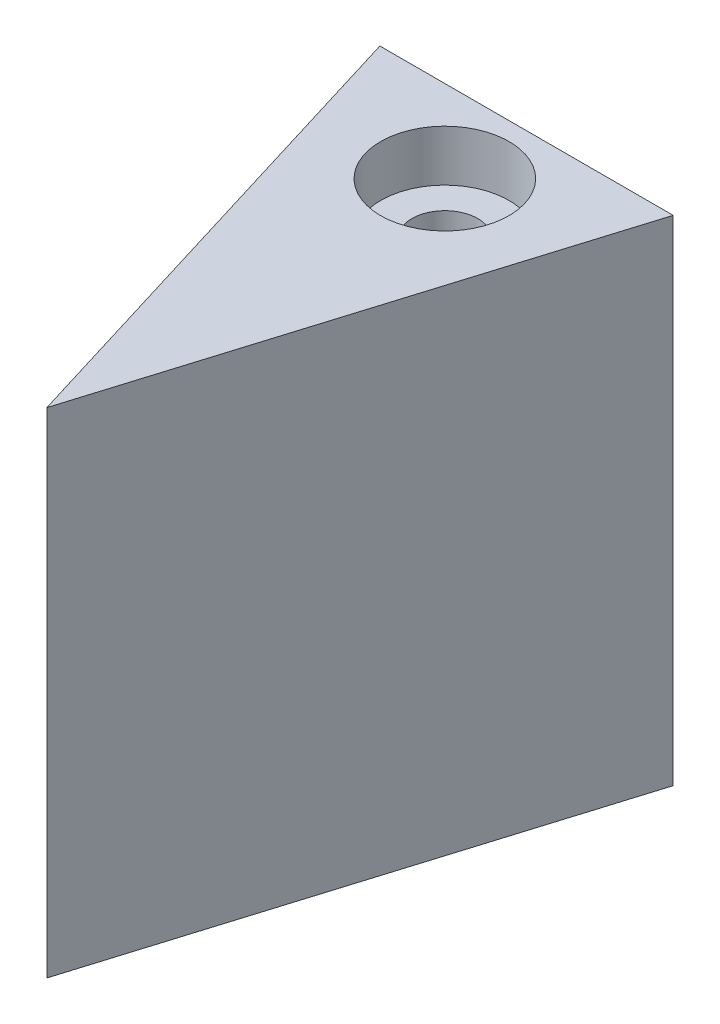
ISO-10303-21;
HEADER;
FILE_DESCRIPTION(('STEP AP214'),'2;1');
FILE_NAME('part.step','',(''),(''),'','','');
FILE_SCHEMA(('AUTOMOTIVE_DESIGN { 1 0 10303 214 1 1 1 1 }'));
ENDSEC;
DATA;
#1=APPLICATION_CONTEXT('core data for automotive mechanical design processes');
#2=APPLICATION_PROTOCOL_DEFINITION('international standard','automotive_design',2000,#1);
#3=PRODUCT_CONTEXT('',#1,'mechanical');
#4=PRODUCT('Part','Part','',(#3));
#5=PRODUCT_RELATED_PRODUCT_CATEGORY('part','',(#4));
#6=PRODUCT_DEFINITION_FORMATION('','',#4);
#7=PRODUCT_DEFINITION_CONTEXT('part definition',#1,'design');
#8=PRODUCT_DEFINITION('design','',#6,#7);
#9=PRODUCT_DEFINITION_SHAPE('','',#8);
#10=(LENGTH_UNIT() NAMED_UNIT(*) SI_UNIT(.MILLI.,.METRE.));
#11=(NAMED_UNIT(*) PLANE_ANGLE_UNIT() SI_UNIT($,.RADIAN.));
#12=(NAMED_UNIT(*) SI_UNIT($,.STERADIAN.) SOLID_ANGLE_UNIT());
#13=UNCERTAINTY_MEASURE_WITH_UNIT(LENGTH_MEASURE(1.E-05),#10,'distance_accuracy_value','');
#14=(GEOMETRIC_REPRESENTATION_CONTEXT(3) GLOBAL_UNCERTAINTY_ASSIGNED_CONTEXT((#13)) GLOBAL_UNIT_ASSIGNED_CONTEXT((#10,
#11,#12)) REPRESENTATION_CONTEXT('',''));
#15=CARTESIAN_POINT('',(0.,0.,0.));
#16=DIRECTION('',(0.,0.,1.));
#17=DIRECTION('',(1.,0.,0.));
#18=AXIS2_PLACEMENT_3D('',#15,#16,#17);
#19=CARTESIAN_POINT('',(-4.47328382881108,-2.51,4.56537000902889));
#20=DIRECTION('',(0.956304755963033,0.,-0.292371704722745));
#21=DIRECTION('',(-0.292371704722745,0.,-0.956304755963033));
#22=AXIS2_PLACEMENT_3D('',#19,#20,#21);
#23=PLANE('',#22);
#24=DIRECTION('',(0.,1.,0.));
#25=VECTOR('',#24,1.);
#26=CARTESIAN_POINT('',(-0.0200292878637927,-2.51,19.1313092850622));
#27=LINE('',#26,#25);
#28=CARTESIAN_POINT('',(-0.0200292878637948,-2.5,19.1313092850622));
#29=VERTEX_POINT('',#28);
#30=CARTESIAN_POINT('',(-0.0200292878637948,12.5,19.1313092850622));
#31=VERTEX_POINT('',#30);
#32=EDGE_CURVE('E11',#29,#31,#27,.T.);
#33=ORIENTED_EDGE('',*,*,#32,.T.);
#34=DIRECTION('',(-0.292371704722745,0.,-0.956304755963033));
#35=VECTOR('',#34,1.);
#36=CARTESIAN_POINT('',(-5.36736335318275,12.5,1.64096765560485));
#37=LINE('',#36,#35);
#38=CARTESIAN_POINT('',(-4.47328382881108,12.5,4.56537000902889));
#39=VERTEX_POINT('',#38);
#40=EDGE_CURVE('E42',#31,#39,#37,.T.);
#41=ORIENTED_EDGE('',*,*,#40,.T.);
#42=DIRECTION('',(0.,-1.,0.));
#43=VECTOR('',#42,1.);
#44=CARTESIAN_POINT('',(-4.47328382881108,-2.5,4.56537000902889));
#45=LINE('',#44,#43);
#46=CARTESIAN_POINT('',(-4.47328382881108,-2.5,4.56537000902889));
#47=VERTEX_POINT('',#46);
#48=EDGE_CURVE('E58',#39,#47,#45,.T.);
#49=ORIENTED_EDGE('',*,*,#48,.T.);
#50=DIRECTION('',(-0.292371704722745,0.,-0.956304755963033));
#51=VECTOR('',#50,1.);
#52=CARTESIAN_POINT('',(-5.36736335318275,-2.5,1.64096765560485));
#53=LINE('',#52,#51);
#54=EDGE_CURVE('E143',#29,#47,#53,.T.);
#55=ORIENTED_EDGE('',*,*,#54,.F.);
#56=EDGE_LOOP('',(#33,#41,#49,#55));
#57=FACE_BOUND('',#56,.T.);
#58=ADVANCED_FACE('F33',(#57),#23,.F.);
#59=CARTESIAN_POINT('',(-0.0200292878637927,-2.51,19.1313092850622));
#60=DIRECTION('',(-0.956304755963036,0.,-0.292371704722737));
#61=DIRECTION('',(-0.292371704722737,0.,0.956304755963036));
#62=AXIS2_PLACEMENT_3D('',#59,#60,#61);
#63=PLANE('',#62);
#64=DIRECTION('',(0.,1.,0.));
#65=VECTOR('',#64,1.);
#66=CARTESIAN_POINT('',(4.43322525308335,-2.5,4.56537000902889));
#67=LINE('',#66,#65);
#68=CARTESIAN_POINT('',(4.43322525308335,-2.5,4.56537000902889));
#69=VERTEX_POINT('',#68);
#70=CARTESIAN_POINT('',(4.43322525308335,12.5,4.56537000902889));
#71=VERTEX_POINT('',#70);
#72=EDGE_CURVE('E156',#69,#71,#67,.T.);
#73=ORIENTED_EDGE('',*,*,#72,.T.);
#74=DIRECTION('',(-0.292371704722737,0.,0.956304755963036));
#75=VECTOR('',#74,1.);
#76=CARTESIAN_POINT('',(5.33072903312821,12.5,1.62976741996975));
#77=LINE('',#76,#75);
#78=EDGE_CURVE('E50',#71,#31,#77,.T.);
#79=ORIENTED_EDGE('',*,*,#78,.T.);
#80=ORIENTED_EDGE('',*,*,#32,.F.);
#81=DIRECTION('',(-0.292371704722737,0.,0.956304755963036));
#82=VECTOR('',#81,1.);
#83=CARTESIAN_POINT('',(5.33072903312821,-2.5,1.62976741996975));
#84=LINE('',#83,#82);
#85=EDGE_CURVE('E37',#69,#29,#84,.T.);
#86=ORIENTED_EDGE('',*,*,#85,.F.);
#87=EDGE_LOOP('',(#73,#79,#80,#86));
#88=FACE_BOUND('',#87,.T.);
#89=ADVANCED_FACE('F35',(#88),#63,.F.);
#90=CARTESIAN_POINT('',(-0.0200292878638651,5.,9.56537000902889));
#91=DIRECTION('',(0.,0.,-1.));
#92=DIRECTION('',(-1.,0.,0.));
#93=AXIS2_PLACEMENT_3D('',#90,#91,#92);
#94=PLANE('',#93);
#95=CARTESIAN_POINT('',(-0.0200292878638651,5.,9.56537000902889));
#96=DIRECTION('',(0.,0.,-1.));
#97=DIRECTION('',(-1.,0.,0.));
#98=AXIS2_PLACEMENT_3D('',#95,#96,#97);
#99=CIRCLE('',#98,3.05);
#100=CARTESIAN_POINT('',(2.87824606137402,4.05,9.56537000902889));
#101=VERTEX_POINT('',#100);
#102=CARTESIAN_POINT('',(-2.91830463710175,4.05,9.56537000902889));
#103=VERTEX_POINT('',#102);
#104=EDGE_CURVE('E124',#101,#103,#99,.T.);
#105=ORIENTED_EDGE('',*,*,#104,.T.);
#106=DIRECTION('',(1.,0.,0.));
#107=VECTOR('',#106,1.);
#108=CARTESIAN_POINT('',(2.87824606137402,4.05,9.56537000902889));
#109=LINE('',#108,#107);
#110=EDGE_CURVE('E127',#103,#101,#109,.T.);
#111=ORIENTED_EDGE('',*,*,#110,.T.);
#112=EDGE_LOOP('',(#105,#111));
#113=FACE_BOUND('',#112,.T.);
#114=ADVANCED_FACE('F221',(#113),#94,.T.);
#115=CARTESIAN_POINT('',(0.,-2.5,7.06537000902889));
#116=DIRECTION('',(0.,1.,0.));
#117=DIRECTION('',(0.,0.,1.));
#118=AXIS2_PLACEMENT_3D('',#115,#116,#117);
#119=CYLINDRICAL_SURFACE('',#118,0.999999999999795);
#120=CARTESIAN_POINT('',(0.,5.95,7.06537000902889));
#121=DIRECTION('',(0.,-1.,0.));
#122=DIRECTION('',(0.,0.,-1.));
#123=AXIS2_PLACEMENT_3D('',#120,#121,#122);
#124=CIRCLE('',#123,0.999999999999795);
#125=CARTESIAN_POINT('',(0.,5.95,6.06537000902909));
#126=VERTEX_POINT('',#125);
#127=EDGE_CURVE('E144',#126,#126,#124,.T.);
#128=ORIENTED_EDGE('',*,*,#127,.F.);
#129=EDGE_LOOP('',(#128));
#130=FACE_BOUND('',#129,.T.);
#131=CARTESIAN_POINT('',(0.,4.05,7.06537000902889));
#132=DIRECTION('',(0.,1.,0.));
#133=DIRECTION('',(0.,0.,1.));
#134=AXIS2_PLACEMENT_3D('',#131,#132,#133);
#135=CIRCLE('',#134,0.999999999999795);
#136=CARTESIAN_POINT('',(0.,4.05,8.06537000902868));
#137=VERTEX_POINT('',#136);
#138=EDGE_CURVE('E188',#137,#137,#135,.T.);
#139=ORIENTED_EDGE('',*,*,#138,.F.);
#140=EDGE_LOOP('',(#139));
#141=FACE_BOUND('',#140,.T.);
#142=ADVANCED_FACE('F198',(#130,#141),#119,.F.);
#143=CARTESIAN_POINT('',(-0.0200292878638651,5.,9.56537000902889));
#144=DIRECTION('',(0.,0.,-1.));
#145=DIRECTION('',(-1.,0.,0.));
#146=AXIS2_PLACEMENT_3D('',#143,#144,#145);
#147=PLANE('',#146);
#148=CARTESIAN_POINT('',(-0.0200292878638651,5.,9.56537000902889));
#149=DIRECTION('',(0.,0.,-1.));
#150=DIRECTION('',(-1.,0.,0.));
#151=AXIS2_PLACEMENT_3D('',#148,#149,#150);
#152=CIRCLE('',#151,3.05);
#153=CARTESIAN_POINT('',(-2.91830463710175,5.95,9.56537000902889));
#154=VERTEX_POINT('',#153);
#155=CARTESIAN_POINT('',(2.87824606137402,5.95,9.56537000902889));
#156=VERTEX_POINT('',#155);
#157=EDGE_CURVE('E100',#154,#156,#152,.T.);
#158=ORIENTED_EDGE('',*,*,#157,.T.);
#159=DIRECTION('',(-1.,0.,0.));
#160=VECTOR('',#159,1.);
#161=CARTESIAN_POINT('',(2.87824606137402,5.95,9.56537000902889));
#162=LINE('',#161,#160);
#163=EDGE_CURVE('E109',#156,#154,#162,.T.);
#164=ORIENTED_EDGE('',*,*,#163,.T.);
#165=EDGE_LOOP('',(#158,#164));
#166=FACE_BOUND('',#165,.T.);
#167=ADVANCED_FACE('F112',(#166),#147,.T.);
#168=CARTESIAN_POINT('',(0.,8.04993423332826,8.06537000902868));
#169=CARTESIAN_POINT('',(0.0546821791008591,8.04957510796066,8.06537003134291));
#170=CARTESIAN_POINT('',(0.109354914126314,8.04773172784493,8.0608700796451));
#171=CARTESIAN_POINT('',(0.217072928600975,8.04124911512673,8.0430513451388));
#172=CARTESIAN_POINT('',(0.270117951898954,8.03660944482241,8.02973118167488));
#173=CARTESIAN_POINT('',(0.373013096085542,8.02501178523379,7.9947834956713));
#174=CARTESIAN_POINT('',(0.422868473539478,8.01805773388006,7.97317007466059));
#175=CARTESIAN_POINT('',(0.518239677542278,8.00251631313627,7.92231226129294));
#176=CARTESIAN_POINT('',(0.563754694999946,7.99392864011109,7.89306644995588));
#177=CARTESIAN_POINT('',(0.650728756928365,7.97567153728033,7.82670873711478));
#178=CARTESIAN_POINT('',(0.692016888170353,7.96597671144104,7.789379829442));
#179=CARTESIAN_POINT('',(0.767869116779319,7.94673554743408,7.7083762283634));
#180=CARTESIAN_POINT('',(0.802431776578928,7.93718924141278,7.66470018173609));
#181=CARTESIAN_POINT('',(0.864765151781457,7.91902793004534,7.5707826132558));
#182=CARTESIAN_POINT('',(0.892326299349008,7.91044519441132,7.52039518357941));
#183=CARTESIAN_POINT('',(0.938505856826815,7.89556616206647,7.41536260915563));
#184=CARTESIAN_POINT('',(0.957127077871142,7.88926914676962,7.36071880910146));
#185=CARTESIAN_POINT('',(0.984242433141647,7.87995461814357,7.25073786122397));
#186=CARTESIAN_POINT('',(0.993067689027361,7.87683020189835,7.19549165552765));
#187=CARTESIAN_POINT('',(1.00137637507627,7.87389140563375,7.0842210997125));
#188=CARTESIAN_POINT('',(1.00086267310011,7.87407600946129,7.02819699375629));
#189=CARTESIAN_POINT('',(0.99076096088365,7.87764266918273,6.91967266210838));
#190=CARTESIAN_POINT('',(0.981587657973599,7.88087859001705,6.86712821582431));
#191=CARTESIAN_POINT('',(0.955100149434765,7.8899509641507,6.76437204334019));
#192=CARTESIAN_POINT('',(0.937784973426303,7.89578772742408,6.71416059597993));
#193=CARTESIAN_POINT('',(0.895224866547381,7.90952145894585,6.61653210436769));
#194=CARTESIAN_POINT('',(0.869854126003332,7.91745075100137,6.56917464604347));
#195=CARTESIAN_POINT('',(0.811993742784764,7.93447527343163,6.47925869308694));
#196=CARTESIAN_POINT('',(0.779502046774439,7.94357083978839,6.43670158801433));
#197=CARTESIAN_POINT('',(0.706310455681535,7.96250407370069,6.35524458013623));
#198=CARTESIAN_POINT('',(0.665269123333407,7.97235562915799,6.31665408360598));
#199=CARTESIAN_POINT('',(0.57718349640282,7.99129803558887,6.24682351617368));
#200=CARTESIAN_POINT('',(0.530138584475256,8.00038880817212,6.21558420213093));
#201=CARTESIAN_POINT('',(0.430676287465459,8.01694054662288,6.16106484602444));
#202=CARTESIAN_POINT('',(0.378205748438876,8.0243825903494,6.13787563631923));
#203=CARTESIAN_POINT('',(0.269803272333861,8.03668686866806,6.10075330920549));
#204=CARTESIAN_POINT('',(0.213872509814023,8.04154997336318,6.08681706955583));
#205=CARTESIAN_POINT('',(0.102675980012124,8.04801791966975,6.06913107849329));
#206=CARTESIAN_POINT('',(0.0474822649655247,8.04975195790472,6.06497514173016));
#207=CARTESIAN_POINT('',(-0.0628415625782379,8.05019803748363,6.0658238541015));
#208=CARTESIAN_POINT('',(-0.11797168444029,8.04891060250071,6.07082691579136));
#209=CARTESIAN_POINT('',(-0.224905098860222,8.04356865345438,6.0895227717292));
#210=CARTESIAN_POINT('',(-0.27675855569376,8.03959688095123,6.10295488916953));
#211=CARTESIAN_POINT('',(-0.377465816854332,8.02940636298488,6.13781410513821));
#212=CARTESIAN_POINT('',(-0.426319262034692,8.02318734910412,6.15924215873627));
#213=CARTESIAN_POINT('',(-0.520961047176242,8.00897230857037,6.2100604659352));
#214=CARTESIAN_POINT('',(-0.566646489467878,8.0009368899842,6.2396309979426));
#215=CARTESIAN_POINT('',(-0.65254261544519,7.98401517307969,6.30568228657445));
#216=CARTESIAN_POINT('',(-0.692751707956591,7.97512862873551,6.34216504424128));
#217=CARTESIAN_POINT('',(-0.768368832186386,7.9570367257478,6.42287653863802));
#218=CARTESIAN_POINT('',(-0.803492685593696,7.94783427305369,6.46737277538544));
#219=CARTESIAN_POINT('',(-0.865812896971176,7.93056297373217,6.561814306128));
#220=CARTESIAN_POINT('',(-0.893009191170616,7.92249413622404,6.61175964395225));
#221=CARTESIAN_POINT('',(-0.938600028099442,7.908487452095,6.71573217026841));
#222=CARTESIAN_POINT('',(-0.957006080265417,7.90254682148472,6.76975391336835));
#223=CARTESIAN_POINT('',(-0.984385447206509,7.89356679235751,6.88036261430816));
#224=CARTESIAN_POINT('',(-0.993362642639482,7.89052620031194,6.93694850680402));
#225=CARTESIAN_POINT('',(-1.00133163032267,7.88782991758724,7.04818230585044));
#226=CARTESIAN_POINT('',(-1.00077845522218,7.8880199719282,7.10279422493158));
#227=CARTESIAN_POINT('',(-0.990816979227545,7.89138344959095,7.21110590212351));
#228=CARTESIAN_POINT('',(-0.981409159874996,7.89455671067717,7.26480570967594));
#229=CARTESIAN_POINT('',(-0.954326006544325,7.90340934975765,7.36885594585062));
#230=CARTESIAN_POINT('',(-0.936795159679116,7.9090448351629,7.41924801009586));
#231=CARTESIAN_POINT('',(-0.894078597598813,7.92216267155434,7.51641516301269));
#232=CARTESIAN_POINT('',(-0.868891247980455,7.92964541680364,7.56318947674054));
#233=CARTESIAN_POINT('',(-0.810369867509382,7.94598359665686,7.6538685388687));
#234=CARTESIAN_POINT('',(-0.776744477808668,7.95488269367938,7.69757735474066));
#235=CARTESIAN_POINT('',(-0.702796321419838,7.97283954400193,7.77888143930107));
#236=CARTESIAN_POINT('',(-0.662471761379352,7.98189733920272,7.81647506561977));
#237=CARTESIAN_POINT('',(-0.574566833244119,7.99951060425292,7.88580532807814));
#238=CARTESIAN_POINT('',(-0.526781666832324,8.00803733466461,7.91729045245042));
#239=CARTESIAN_POINT('',(-0.42631739774142,8.02324420992155,7.97174481231142));
#240=CARTESIAN_POINT('',(-0.373639825535698,8.02992492966523,7.99471669981805));
#241=CARTESIAN_POINT('',(-0.268082191246842,8.04033135878708,8.03027889077588));
#242=CARTESIAN_POINT('',(-0.215395649662781,8.0442075496374,8.0433995880839));
#243=CARTESIAN_POINT('',(-0.108469393021745,8.04918673358594,8.06094409709436));
#244=CARTESIAN_POINT('',(-0.0542300522364904,8.05029038935139,8.06536998689896));
#245=CARTESIAN_POINT('',(0.,8.04993423332826,8.06537000902868));
#246=B_SPLINE_CURVE_WITH_KNOTS('',3,(#168,#169,#170,#171,#172,#173,#174,#175,#176,#177,#178,
#179,#180,#181,#182,#183,#184,#185,#186,#187,#188,#189,#190,#191,#192,#193,#194,#195,#196,#197,
#198,#199,#200,#201,#202,#203,#204,#205,#206,#207,#208,#209,#210,#211,#212,#213,#214,#215,#216,
#217,#218,#219,#220,#221,#222,#223,#224,#225,#226,#227,#228,#229,#230,#231,#232,#233,#234,#235,
#236,#237,#238,#239,#240,#241,#242,#243,#244,#245),.UNSPECIFIED.,.T.,.F.,(4,2,2,2,2,2,2,2,2,2,2,
2,2,2,2,2,2,2,2,2,2,2,2,2,2,2,2,2,2,2,2,2,2,2,2,2,2,2,4),(0.,0.163850025249576,
0.327725704522648,0.491323962064708,0.654952656763252,0.823688007705309,0.992459386251062,
1.16580686426493,1.33909979790541,1.50633759959778,1.67352404581624,1.83308952664912,
1.99267402993055,2.15488479838887,2.31714240219587,2.48792062945066,2.65871643191758,
2.83138111770078,3.00398751137513,3.16928819199399,3.33456022528501,3.49495717905625,
3.65537329747941,3.81967478229688,3.98402390415546,4.15550728499603,4.32699204524211,
4.49825165341348,4.66944074819149,4.83247997411711,4.99551033400225,5.15574601024891,
5.31601591541804,5.48284858292629,5.64972598333098,5.8224532304353,5.99512662474744,
6.15766074540814,6.32015601487876),.UNSPECIFIED.);
#247=CARTESIAN_POINT('',(0.,8.04993423332826,8.06537000902868));
#248=VERTEX_POINT('',#247);
#249=EDGE_CURVE('E147',#248,#248,#246,.T.);
#250=ORIENTED_EDGE('',*,*,#249,.F.);
#251=EDGE_LOOP('',(#250));
#252=FACE_BOUND('',#251,.T.);
#253=CARTESIAN_POINT('',(0.,10.95,7.06537000902889));
#254=DIRECTION('',(0.,1.,0.));
#255=DIRECTION('',(0.,0.,1.));
#256=AXIS2_PLACEMENT_3D('',#253,#254,#255);
#257=CIRCLE('',#256,0.999999999999795);
#258=CARTESIAN_POINT('',(0.,10.95,8.06537000902868));
#259=VERTEX_POINT('',#258);
#260=EDGE_CURVE('E149',#259,#259,#257,.F.);
#261=ORIENTED_EDGE('',*,*,#260,.F.);
#262=EDGE_LOOP('',(#261));
#263=FACE_BOUND('',#262,.T.);
#264=ADVANCED_FACE('F197',(#252,#263),#119,.F.);
#265=CARTESIAN_POINT('',(0.,10.95,7.06537000902889));
#266=DIRECTION('',(0.,1.,0.));
#267=DIRECTION('',(0.,0.,1.));
#268=AXIS2_PLACEMENT_3D('',#265,#266,#267);
#269=PLANE('',#268);
#270=CARTESIAN_POINT('',(0.,10.95,7.06537000902889));
#271=DIRECTION('',(0.,1.,0.));
#272=DIRECTION('',(0.,0.,1.));
#273=AXIS2_PLACEMENT_3D('',#270,#271,#272);
#274=CIRCLE('',#273,1.95);
#275=CARTESIAN_POINT('',(0.,10.95,9.01537000902889));
#276=VERTEX_POINT('',#275);
#277=EDGE_CURVE('E152',#276,#276,#274,.T.);
#278=ORIENTED_EDGE('',*,*,#277,.T.);
#279=EDGE_LOOP('',(#278));
#280=FACE_BOUND('',#279,.T.);
#281=ORIENTED_EDGE('',*,*,#260,.T.);
#282=EDGE_LOOP('',(#281));
#283=FACE_BOUND('',#282,.T.);
#284=ADVANCED_FACE('F238',(#280,#283),#269,.T.);
#285=CARTESIAN_POINT('',(2.87824606137402,4.05,9.56537000902889));
#286=DIRECTION('',(0.,1.,0.));
#287=DIRECTION('',(0.,0.,1.));
#288=AXIS2_PLACEMENT_3D('',#285,#286,#287);
#289=PLANE('',#288);
#290=ORIENTED_EDGE('',*,*,#138,.T.);
#291=EDGE_LOOP('',(#290));
#292=FACE_BOUND('',#291,.T.);
#293=DIRECTION('',(1.,0.,0.));
#294=VECTOR('',#293,1.);
#295=CARTESIAN_POINT('',(2.87824606137402,4.05,4.56537000902889));
#296=LINE('',#295,#294);
#297=CARTESIAN_POINT('',(-2.91830463710175,4.05,4.56537000902889));
#298=VERTEX_POINT('',#297);
#299=CARTESIAN_POINT('',(2.87824606137402,4.05,4.56537000902889));
#300=VERTEX_POINT('',#299);
#301=EDGE_CURVE('E128',#298,#300,#296,.T.);
#302=ORIENTED_EDGE('',*,*,#301,.T.);
#303=DIRECTION('',(0.,0.,-1.));
#304=VECTOR('',#303,1.);
#305=CARTESIAN_POINT('',(2.87824606137402,4.05,9.56537000902889));
#306=LINE('',#305,#304);
#307=EDGE_CURVE('E135',#101,#300,#306,.T.);
#308=ORIENTED_EDGE('',*,*,#307,.F.);
#309=ORIENTED_EDGE('',*,*,#110,.F.);
#310=DIRECTION('',(0.,0.,-1.));
#311=VECTOR('',#310,1.);
#312=CARTESIAN_POINT('',(-2.91830463710175,4.05,9.56537000902889));
#313=LINE('',#312,#311);
#314=EDGE_CURVE('E131',#103,#298,#313,.T.);
#315=ORIENTED_EDGE('',*,*,#314,.T.);
#316=EDGE_LOOP('',(#302,#308,#309,#315));
#317=FACE_BOUND('',#316,.T.);
#318=ADVANCED_FACE('F210',(#292,#317),#289,.F.);
#319=CARTESIAN_POINT('',(-0.0200292878638651,5.,9.56537000902889));
#320=DIRECTION('',(0.,0.,-1.));
#321=DIRECTION('',(-1.,0.,0.));
#322=AXIS2_PLACEMENT_3D('',#319,#320,#321);
#323=CYLINDRICAL_SURFACE('',#322,3.05);
#324=CARTESIAN_POINT('',(0.,1.95006576667174,8.06537000902868));
#325=CARTESIAN_POINT('',(-0.0545467083170213,1.94970747285087,8.06537014842768));
#326=CARTESIAN_POINT('',(-0.109102594425875,1.95082617973328,8.0608924995377));
#327=CARTESIAN_POINT('',(-0.216630559947825,1.95586683343102,8.04314372343465));
#328=CARTESIAN_POINT('',(-0.269602455019722,1.95978910520613,8.02987157686885));
#329=CARTESIAN_POINT('',(-0.372395540865111,1.96998281568037,7.9950275098491));
#330=CARTESIAN_POINT('',(-0.422221565195225,1.97625054265354,7.973468701733));
#331=CARTESIAN_POINT('',(-0.517558158763021,1.99046661490332,7.92272142069787));
#332=CARTESIAN_POINT('',(-0.563067913976883,1.9984152762853,7.89353151248061));
#333=CARTESIAN_POINT('',(-0.649966255197754,2.0154231807719,7.82735020137387));
#334=CARTESIAN_POINT('',(-0.691194169171496,2.02450822082243,7.79015451043477));
#335=CARTESIAN_POINT('',(-0.766956256715783,2.04261595831002,7.7094526800914));
#336=CARTESIAN_POINT('',(-0.801489039696813,2.05163864242117,7.66594523299885));
#337=CARTESIAN_POINT('',(-0.863833114798163,2.06886144062743,7.57236170710818));
#338=CARTESIAN_POINT('',(-0.891427757355958,2.07703123807653,7.5221351619421));
#339=CARTESIAN_POINT('',(-0.937715224095409,2.09122999962885,7.41745339240553));
#340=CARTESIAN_POINT('',(-0.956410489644233,2.09725955075052,7.36299933254285));
#341=CARTESIAN_POINT('',(-0.98378774157987,2.10623552314352,7.25316209699885));
#342=CARTESIAN_POINT('',(-0.992758921547917,2.10927073194073,7.19785848159756));
#343=CARTESIAN_POINT('',(-1.00133622536939,2.1121705310223,7.08645414512163));
#344=CARTESIAN_POINT('',(-1.00094504098822,2.11203603262665,7.03035365779079));
#345=CARTESIAN_POINT('',(-0.991038308718468,2.10869152283109,6.92147912268892));
#346=CARTESIAN_POINT('',(-0.981911130689609,2.10561242249054,6.86866501351363));
#347=CARTESIAN_POINT('',(-0.955426185023448,2.09694560803578,6.76536168143749));
#348=CARTESIAN_POINT('',(-0.938067486579282,2.09135761022334,6.71487272216934));
#349=CARTESIAN_POINT('',(-0.895355477528405,2.07821837470153,6.6167672431692));
#350=CARTESIAN_POINT('',(-0.869886126954097,2.07063893932841,6.5692051855977));
#351=CARTESIAN_POINT('',(-0.811753224255465,2.05439616233121,6.47890419675966));
#352=CARTESIAN_POINT('',(-0.779087700884409,2.04573252399295,6.43616659191586));
#353=CARTESIAN_POINT('',(-0.705621370189618,2.02780243830253,6.35455640683283));
#354=CARTESIAN_POINT('',(-0.664503649472307,2.01852709526581,6.31597050530051));
#355=CARTESIAN_POINT('',(-0.57625917050636,2.00081162712214,6.24616898216816));
#356=CARTESIAN_POINT('',(-0.529131951252226,1.99237156618035,6.21495392653086));
#357=CARTESIAN_POINT('',(-0.42967631027486,1.97721392807559,6.16059752963539));
#358=CARTESIAN_POINT('',(-0.377310405391615,1.97051020892516,6.13752064297751));
#359=CARTESIAN_POINT('',(-0.269171299120882,1.9597079998363,6.10058591678685));
#360=CARTESIAN_POINT('',(-0.213399241292621,1.95560864074058,6.08672500152104));
#361=CARTESIAN_POINT('',(-0.10253908456766,1.95063259271298,6.06912548318687));
#362=CARTESIAN_POINT('',(-0.0475199824239522,1.94962825812152,6.06498767267624));
#363=CARTESIAN_POINT('',(0.0624178408306011,1.95061930503421,6.06580783262257));
#364=CARTESIAN_POINT('',(0.117336575934049,1.95261423039507,6.07076441998072));
#365=CARTESIAN_POINT('',(0.224019697915292,1.95932166494474,6.08932142334608));
#366=CARTESIAN_POINT('',(0.275829029613629,1.96396161104079,6.10269199072763));
#367=CARTESIAN_POINT('',(0.376441018754687,1.97545416982598,6.1374016340776));
#368=CARTESIAN_POINT('',(0.425243272951458,1.98230707850544,6.15874177606015));
#369=CARTESIAN_POINT('',(0.519942958677845,1.99778474493448,6.20943615236094));
#370=CARTESIAN_POINT('',(0.565724086676077,2.00645292462781,6.23899404054972));
#371=CARTESIAN_POINT('',(0.65180500165392,2.02458793082162,6.30504407730197));
#372=CARTESIAN_POINT('',(0.692103118494657,2.03405499924922,6.34153833062207));
#373=CARTESIAN_POINT('',(0.767932225486806,2.05327037108428,6.42234306540777));
#374=CARTESIAN_POINT('',(0.803172677487142,2.06301253612594,6.46692833440378));
#375=CARTESIAN_POINT('',(0.865699423276716,2.08125899142385,6.5616021249502));
#376=CARTESIAN_POINT('',(0.892985766856479,2.08976328942864,6.61169061204926));
#377=CARTESIAN_POINT('',(0.938651779165637,2.10448494111707,6.71586576519746));
#378=CARTESIAN_POINT('',(0.957065998669795,2.11071114322027,6.76993596046547));
#379=CARTESIAN_POINT('',(0.984445615434366,2.12011390689645,6.88066589489971));
#380=CARTESIAN_POINT('',(0.993415282022461,2.12329184635206,6.93732445192374));
#381=CARTESIAN_POINT('',(1.00132679388868,2.12609197133263,7.04845788777591));
#382=CARTESIAN_POINT('',(1.00076507768828,2.12589019545742,7.10289342027352));
#383=CARTESIAN_POINT('',(0.990844746741187,2.12238627741313,7.21085016959212));
#384=CARTESIAN_POINT('',(0.981486635847406,2.11908431282127,7.26437143860285));
#385=CARTESIAN_POINT('',(0.954582416471499,2.1098742046831,7.36800345557402));
#386=CARTESIAN_POINT('',(0.937190144831295,2.10401513574912,7.41815883854906));
#387=CARTESIAN_POINT('',(0.894835988822796,2.090358382842,7.51487803621554));
#388=CARTESIAN_POINT('',(0.869872431323104,2.08256027044038,7.56144105419678));
#389=CARTESIAN_POINT('',(0.811804845722808,2.06546338643234,7.65187315687851));
#390=CARTESIAN_POINT('',(0.778391036585527,2.05611369258926,7.69553364274029));
#391=CARTESIAN_POINT('',(0.704904242322278,2.03716191630836,7.77678571189248));
#392=CARTESIAN_POINT('',(0.664829330890099,2.02755976154021,7.81437553340602));
#393=CARTESIAN_POINT('',(0.577262492650444,2.0087087644859,7.88391432033876));
#394=CARTESIAN_POINT('',(0.529540250451134,1.99948882586492,7.91558208528871));
#395=CARTESIAN_POINT('',(0.42915302715261,1.98282933317401,7.97040925400301));
#396=CARTESIAN_POINT('',(0.376489408870778,1.97538929021161,7.99357099509525));
#397=CARTESIAN_POINT('',(0.270526055479718,1.96342787080536,8.02962243255354));
#398=CARTESIAN_POINT('',(0.21740168051063,1.95877488381879,8.04298349104672));
#399=CARTESIAN_POINT('',(0.109520989825704,1.95227407622703,8.06085600970638));
#400=CARTESIAN_POINT('',(0.0547651206314484,1.95042549514897,8.06536986907151));
#401=CARTESIAN_POINT('',(0.,1.95006576667174,8.06537000902868));
#402=B_SPLINE_CURVE_WITH_KNOTS('',3,(#324,#325,#326,#327,#328,#329,#330,#331,#332,#333,#334,
#335,#336,#337,#338,#339,#340,#341,#342,#343,#344,#345,#346,#347,#348,#349,#350,#351,#352,#353,
#354,#355,#356,#357,#358,#359,#360,#361,#362,#363,#364,#365,#366,#367,#368,#369,#370,#371,#372,
#373,#374,#375,#376,#377,#378,#379,#380,#381,#382,#383,#384,#385,#386,#387,#388,#389,#390,#391,
#392,#393,#394,#395,#396,#397,#398,#399,#400,#401),.UNSPECIFIED.,.T.,.F.,(4,2,2,2,2,2,2,2,2,2,2,
2,2,2,2,2,2,2,2,2,2,2,2,2,2,2,2,2,2,2,2,2,2,2,2,2,2,2,4),(0.,0.163442738145022,
0.326904423927134,0.490108515076376,0.653343324638449,0.821381387841708,0.989454315519196,
1.16225995148931,1.33501815430968,1.50248425360626,1.66990220544567,1.83020712775361,
1.99053018140408,2.15325864915569,2.31603174864767,2.48667281288232,2.65732697535582,
2.82930387628821,3.00122335289978,3.16595058911983,3.33065277528572,3.49104017270917,
3.65144903131624,3.81625518004188,3.98111141728132,4.15327611944035,4.32543974387269,
4.49692737970757,4.66833746273024,4.83084843459238,4.993350098478,5.15286155264116,
5.31240828196405,5.4789731824826,5.64558633552872,5.81877562096729,5.9919172809142,
6.15605898403024,6.32015616875538),.UNSPECIFIED.);
#403=CARTESIAN_POINT('',(0.,1.95006576667174,8.06537000902868));
#404=VERTEX_POINT('',#403);
#405=EDGE_CURVE('E120',#404,#404,#402,.T.);
#406=ORIENTED_EDGE('',*,*,#405,.T.);
#407=EDGE_LOOP('',(#406));
#408=FACE_BOUND('',#407,.T.);
#409=CARTESIAN_POINT('',(-0.0200292878638651,5.,4.56537000902889));
#410=DIRECTION('',(0.,0.,-1.));
#411=DIRECTION('',(-1.,0.,0.));
#412=AXIS2_PLACEMENT_3D('',#409,#410,#411);
#413=CIRCLE('',#412,3.05);
#414=EDGE_CURVE('E122',#300,#298,#413,.T.);
#415=ORIENTED_EDGE('',*,*,#414,.T.);
#416=ORIENTED_EDGE('',*,*,#314,.F.);
#417=ORIENTED_EDGE('',*,*,#104,.F.);
#418=ORIENTED_EDGE('',*,*,#307,.T.);
#419=EDGE_LOOP('',(#415,#416,#417,#418));
#420=FACE_BOUND('',#419,.T.);
#421=ADVANCED_FACE('F206',(#408,#420),#323,.F.);
#422=CARTESIAN_POINT('',(2.87824606137402,5.95,9.56537000902889));
#423=DIRECTION('',(0.,-1.,0.));
#424=DIRECTION('',(0.,0.,-1.));
#425=AXIS2_PLACEMENT_3D('',#422,#423,#424);
#426=PLANE('',#425);
#427=ORIENTED_EDGE('',*,*,#127,.T.);
#428=EDGE_LOOP('',(#427));
#429=FACE_BOUND('',#428,.T.);
#430=DIRECTION('',(-1.,0.,0.));
#431=VECTOR('',#430,1.);
#432=CARTESIAN_POINT('',(2.87824606137402,5.95,4.56537000902889));
#433=LINE('',#432,#431);
#434=CARTESIAN_POINT('',(2.87824606137402,5.95,4.56537000902889));
#435=VERTEX_POINT('',#434);
#436=CARTESIAN_POINT('',(-2.91830463710175,5.95,4.56537000902889));
#437=VERTEX_POINT('',#436);
#438=EDGE_CURVE('E113',#435,#437,#433,.T.);
#439=ORIENTED_EDGE('',*,*,#438,.T.);
#440=DIRECTION('',(0.,0.,-1.));
#441=VECTOR('',#440,1.);
#442=CARTESIAN_POINT('',(-2.91830463710175,5.95,9.56537000902889));
#443=LINE('',#442,#441);
#444=EDGE_CURVE('E108',#154,#437,#443,.T.);
#445=ORIENTED_EDGE('',*,*,#444,.F.);
#446=ORIENTED_EDGE('',*,*,#163,.F.);
#447=DIRECTION('',(0.,0.,-1.));
#448=VECTOR('',#447,1.);
#449=CARTESIAN_POINT('',(2.87824606137402,5.95,9.56537000902889));
#450=LINE('',#449,#448);
#451=EDGE_CURVE('E97',#156,#435,#450,.T.);
#452=ORIENTED_EDGE('',*,*,#451,.T.);
#453=EDGE_LOOP('',(#439,#445,#446,#452));
#454=FACE_BOUND('',#453,.T.);
#455=ADVANCED_FACE('F115',(#429,#454),#426,.F.);
#456=CARTESIAN_POINT('',(-0.0200292878638651,5.,9.56537000902889));
#457=DIRECTION('',(0.,0.,-1.));
#458=DIRECTION('',(-1.,0.,0.));
#459=AXIS2_PLACEMENT_3D('',#456,#457,#458);
#460=CYLINDRICAL_SURFACE('',#459,3.05);
#461=ORIENTED_EDGE('',*,*,#249,.T.);
#462=EDGE_LOOP('',(#461));
#463=FACE_BOUND('',#462,.T.);
#464=CARTESIAN_POINT('',(-0.0200292878638651,5.,4.56537000902889));
#465=DIRECTION('',(0.,0.,-1.));
#466=DIRECTION('',(-1.,0.,0.));
#467=AXIS2_PLACEMENT_3D('',#464,#465,#466);
#468=CIRCLE('',#467,3.05);
#469=EDGE_CURVE('E103',#437,#435,#468,.T.);
#470=ORIENTED_EDGE('',*,*,#469,.T.);
#471=ORIENTED_EDGE('',*,*,#451,.F.);
#472=ORIENTED_EDGE('',*,*,#157,.F.);
#473=ORIENTED_EDGE('',*,*,#444,.T.);
#474=EDGE_LOOP('',(#470,#471,#472,#473));
#475=FACE_BOUND('',#474,.T.);
#476=ADVANCED_FACE('F99',(#463,#475),#460,.F.);
#477=CARTESIAN_POINT('',(0.,10.95,7.06537000902889));
#478=DIRECTION('',(0.,1.,0.));
#479=DIRECTION('',(0.,0.,1.));
#480=AXIS2_PLACEMENT_3D('',#477,#478,#479);
#481=CYLINDRICAL_SURFACE('',#480,1.95);
#482=CARTESIAN_POINT('',(0.,12.5,7.06537000902889));
#483=DIRECTION('',(0.,1.,0.));
#484=DIRECTION('',(0.,0.,1.));
#485=AXIS2_PLACEMENT_3D('',#482,#483,#484);
#486=CIRCLE('',#485,1.95);
#487=CARTESIAN_POINT('',(0.,12.5,9.01537000902889));
#488=VERTEX_POINT('',#487);
#489=EDGE_CURVE('E174',#488,#488,#486,.T.);
#490=CARTESIAN_POINT('',(0.,10.95,9.01537000902889));
#491=CARTESIAN_POINT('',(0.,10.9661458333333,9.01537000902889));
#492=CARTESIAN_POINT('',(0.,10.9822916666667,9.01537000902889));
#493=CARTESIAN_POINT('',(0.,11.0145833333333,9.01537000902889));
#494=CARTESIAN_POINT('',(0.,11.0307291666667,9.01537000902889));
#495=CARTESIAN_POINT('',(0.,11.0630208333333,9.01537000902889));
#496=CARTESIAN_POINT('',(0.,11.0791666666667,9.01537000902889));
#497=CARTESIAN_POINT('',(0.,11.1114583333333,9.01537000902889));
#498=CARTESIAN_POINT('',(0.,11.1276041666667,9.01537000902889));
#499=CARTESIAN_POINT('',(0.,11.1598958333333,9.01537000902889));
#500=CARTESIAN_POINT('',(0.,11.1760416666667,9.01537000902889));
#501=CARTESIAN_POINT('',(0.,11.2083333333333,9.01537000902889));
#502=CARTESIAN_POINT('',(0.,11.2244791666667,9.01537000902889));
#503=CARTESIAN_POINT('',(0.,11.2567708333333,9.01537000902889));
#504=CARTESIAN_POINT('',(0.,11.2729166666667,9.01537000902889));
#505=CARTESIAN_POINT('',(0.,11.3052083333333,9.01537000902889));
#506=CARTESIAN_POINT('',(0.,11.3213541666667,9.01537000902889));
#507=CARTESIAN_POINT('',(0.,11.3536458333333,9.01537000902889));
#508=CARTESIAN_POINT('',(0.,11.3697916666667,9.01537000902889));
#509=CARTESIAN_POINT('',(0.,11.4020833333333,9.01537000902889));
#510=CARTESIAN_POINT('',(0.,11.4182291666667,9.01537000902889));
#511=CARTESIAN_POINT('',(0.,11.4505208333333,9.01537000902889));
#512=CARTESIAN_POINT('',(0.,11.4666666666667,9.01537000902889));
#513=CARTESIAN_POINT('',(0.,11.4989583333333,9.01537000902889));
#514=CARTESIAN_POINT('',(0.,11.5151041666667,9.01537000902889));
#515=CARTESIAN_POINT('',(0.,11.5473958333333,9.01537000902889));
#516=CARTESIAN_POINT('',(0.,11.5635416666667,9.01537000902889));
#517=CARTESIAN_POINT('',(0.,11.5958333333333,9.01537000902889));
#518=CARTESIAN_POINT('',(0.,11.6119791666667,9.01537000902889));
#519=CARTESIAN_POINT('',(0.,11.6442708333333,9.01537000902889));
#520=CARTESIAN_POINT('',(0.,11.6604166666667,9.01537000902889));
#521=CARTESIAN_POINT('',(0.,11.6927083333333,9.01537000902889));
#522=CARTESIAN_POINT('',(0.,11.7088541666667,9.01537000902889));
#523=CARTESIAN_POINT('',(0.,11.7411458333333,9.01537000902889));
#524=CARTESIAN_POINT('',(0.,11.7572916666667,9.01537000902889));
#525=CARTESIAN_POINT('',(0.,11.7895833333333,9.01537000902889));
#526=CARTESIAN_POINT('',(0.,11.8057291666667,9.01537000902889));
#527=CARTESIAN_POINT('',(0.,11.8380208333333,9.01537000902889));
#528=CARTESIAN_POINT('',(0.,11.8541666666667,9.01537000902889));
#529=CARTESIAN_POINT('',(0.,11.8864583333333,9.01537000902889));
#530=CARTESIAN_POINT('',(0.,11.9026041666667,9.01537000902889));
#531=CARTESIAN_POINT('',(0.,11.9348958333333,9.01537000902889));
#532=CARTESIAN_POINT('',(0.,11.9510416666667,9.01537000902889));
#533=CARTESIAN_POINT('',(0.,11.9833333333333,9.01537000902889));
#534=CARTESIAN_POINT('',(0.,11.9994791666667,9.01537000902889));
#535=CARTESIAN_POINT('',(0.,12.0317708333333,9.01537000902889));
#536=CARTESIAN_POINT('',(0.,12.0479166666667,9.01537000902889));
#537=CARTESIAN_POINT('',(0.,12.0802083333333,9.01537000902889));
#538=CARTESIAN_POINT('',(0.,12.0963541666667,9.01537000902889));
#539=CARTESIAN_POINT('',(0.,12.1286458333333,9.01537000902889));
#540=CARTESIAN_POINT('',(0.,12.1447916666667,9.01537000902889));
#541=CARTESIAN_POINT('',(0.,12.1770833333333,9.01537000902889));
#542=CARTESIAN_POINT('',(0.,12.1932291666667,9.01537000902889));
#543=CARTESIAN_POINT('',(0.,12.2255208333333,9.01537000902889));
#544=CARTESIAN_POINT('',(0.,12.2416666666667,9.01537000902889));
#545=CARTESIAN_POINT('',(0.,12.2739583333333,9.01537000902889));
#546=CARTESIAN_POINT('',(0.,12.2901041666667,9.01537000902889));
#547=CARTESIAN_POINT('',(0.,12.3223958333333,9.01537000902889));
#548=CARTESIAN_POINT('',(0.,12.3385416666667,9.01537000902889));
#549=CARTESIAN_POINT('',(0.,12.3708333333333,9.01537000902889));
#550=CARTESIAN_POINT('',(0.,12.3869791666667,9.01537000902889));
#551=CARTESIAN_POINT('',(0.,12.4192708333333,9.01537000902889));
#552=CARTESIAN_POINT('',(0.,12.4354166666667,9.01537000902889));
#553=CARTESIAN_POINT('',(0.,12.4677083333333,9.01537000902889));
#554=CARTESIAN_POINT('',(0.,12.4838541666667,9.01537000902889));
#555=CARTESIAN_POINT('',(0.,12.5,9.01537000902889));
#556=B_SPLINE_CURVE_WITH_KNOTS('',3,(#490,#491,#492,#493,#494,#495,#496,#497,#498,#499,#500,
#501,#502,#503,#504,#505,#506,#507,#508,#509,#510,#511,#512,#513,#514,#515,#516,#517,#518,#519,
#520,#521,#522,#523,#524,#525,#526,#527,#528,#529,#530,#531,#532,#533,#534,#535,#536,#537,#538,
#539,#540,#541,#542,#543,#544,#545,#546,#547,#548,#549,#550,#551,#552,#553,#554,#555),
.UNSPECIFIED.,.F.,.F.,(4,2,2,2,2,2,2,2,2,2,2,2,2,2,2,2,2,2,2,2,2,2,2,2,2,2,2,2,2,2,2,2,4),(0.,
0.0484375000000016,0.0968750000000015,0.145312500000001,0.193750000000001,0.242187500000001,
0.290625000000001,0.339062500000001,0.387500000000001,0.435937500000001,0.484375,0.5328125,
0.58125,0.6296875,0.678125,0.7265625,0.775,0.823437500000001,0.871875000000001,
0.920312500000001,0.968750000000001,1.0171875,1.065625,1.1140625,1.1625,1.2109375,1.259375,
1.3078125,1.35625,1.4046875,1.453125,1.5015625,1.55),.UNSPECIFIED.);
#557=EDGE_CURVE('BSEAM199',#276,#488,#556,.T.);
#558=ORIENTED_EDGE('',*,*,#277,.F.);
#559=ORIENTED_EDGE('',*,*,#489,.T.);
#560=ORIENTED_EDGE('',*,*,#557,.T.);
#561=ORIENTED_EDGE('',*,*,#557,.F.);
#562=EDGE_LOOP('',(#558,#560,#559,#561));
#563=FACE_BOUND('',#562,.T.);
#564=ADVANCED_FACE('F199',(#563),#481,.F.);
#565=CARTESIAN_POINT('',(4.64236360438078,-2.5,4.56537000902889));
#566=DIRECTION('',(0.,0.,-1.));
#567=DIRECTION('',(-1.,0.,0.));
#568=AXIS2_PLACEMENT_3D('',#565,#566,#567);
#569=PLANE('',#568);
#570=ORIENTED_EDGE('',*,*,#72,.F.);
#571=DIRECTION('',(-1.,0.,0.));
#572=VECTOR('',#571,1.);
#573=CARTESIAN_POINT('',(4.64236360438078,-2.5,4.56537000902889));
#574=LINE('',#573,#572);
#575=EDGE_CURVE('E141',#69,#47,#574,.T.);
#576=ORIENTED_EDGE('',*,*,#575,.T.);
#577=ORIENTED_EDGE('',*,*,#48,.F.);
#578=DIRECTION('',(-1.,0.,0.));
#579=VECTOR('',#578,1.);
#580=CARTESIAN_POINT('',(4.64236360438078,12.5,4.56537000902889));
#581=LINE('',#580,#579);
#582=EDGE_CURVE('E137',#71,#39,#581,.T.);
#583=ORIENTED_EDGE('',*,*,#582,.F.);
#584=EDGE_LOOP('',(#570,#576,#577,#583));
#585=FACE_BOUND('',#584,.T.);
#586=ORIENTED_EDGE('',*,*,#469,.F.);
#587=ORIENTED_EDGE('',*,*,#438,.F.);
#588=EDGE_LOOP('',(#586,#587));
#589=FACE_BOUND('',#588,.T.);
#590=ORIENTED_EDGE('',*,*,#414,.F.);
#591=ORIENTED_EDGE('',*,*,#301,.F.);
#592=EDGE_LOOP('',(#590,#591));
#593=FACE_BOUND('',#592,.T.);
#594=ADVANCED_FACE('F165',(#585,#589,#593),#569,.T.);
#595=CARTESIAN_POINT('',(0.,12.5,0.));
#596=DIRECTION('',(0.,1.,0.));
#597=DIRECTION('',(0.,0.,1.));
#598=AXIS2_PLACEMENT_3D('',#595,#596,#597);
#599=PLANE('',#598);
#600=ORIENTED_EDGE('',*,*,#78,.F.);
#601=ORIENTED_EDGE('',*,*,#582,.T.);
#602=ORIENTED_EDGE('',*,*,#40,.F.);
#603=EDGE_LOOP('',(#600,#601,#602));
#604=FACE_BOUND('',#603,.T.);
#605=ORIENTED_EDGE('',*,*,#489,.F.);
#606=EDGE_LOOP('',(#605));
#607=FACE_BOUND('',#606,.T.);
#608=ADVANCED_FACE('F167',(#604,#607),#599,.T.);
#609=CARTESIAN_POINT('',(0.,-2.5,7.06537000902889));
#610=DIRECTION('',(0.,1.,0.));
#611=DIRECTION('',(0.,0.,1.));
#612=AXIS2_PLACEMENT_3D('',#609,#610,#611);
#613=CIRCLE('',#612,0.999999999999795);
#614=CARTESIAN_POINT('',(0.,-2.5,8.06537000902868));
#615=VERTEX_POINT('',#614);
#616=EDGE_CURVE('E148',#615,#615,#613,.T.);
#617=ORIENTED_EDGE('',*,*,#616,.F.);
#618=EDGE_LOOP('',(#617));
#619=FACE_BOUND('',#618,.T.);
#620=ORIENTED_EDGE('',*,*,#405,.F.);
#621=EDGE_LOOP('',(#620));
#622=FACE_BOUND('',#621,.T.);
#623=ADVANCED_FACE('F170',(#619,#622),#119,.F.);
#624=CARTESIAN_POINT('',(0.,-2.5,0.));
#625=DIRECTION('',(0.,1.,0.));
#626=DIRECTION('',(0.,0.,1.));
#627=AXIS2_PLACEMENT_3D('',#624,#625,#626);
#628=PLANE('',#627);
#629=ORIENTED_EDGE('',*,*,#616,.T.);
#630=EDGE_LOOP('',(#629));
#631=FACE_BOUND('',#630,.T.);
#632=ORIENTED_EDGE('',*,*,#575,.F.);
#633=ORIENTED_EDGE('',*,*,#85,.T.);
#634=ORIENTED_EDGE('',*,*,#54,.T.);
#635=EDGE_LOOP('',(#632,#633,#634));
#636=FACE_BOUND('',#635,.T.);
#637=ADVANCED_FACE('F161',(#631,#636),#628,.F.);
#638=CLOSED_SHELL('',(#58,#89,#114,#142,#167,#264,#284,#318,#421,#455,#476,#564,#594,#608,#623,#637));
#639=MANIFOLD_SOLID_BREP('B2',#638);
#640=ADVANCED_BREP_SHAPE_REPRESENTATION('',(#18,#639),#14);
#641=SHAPE_DEFINITION_REPRESENTATION(#9,#640);
ENDSEC;
END-ISO-10303-21;
